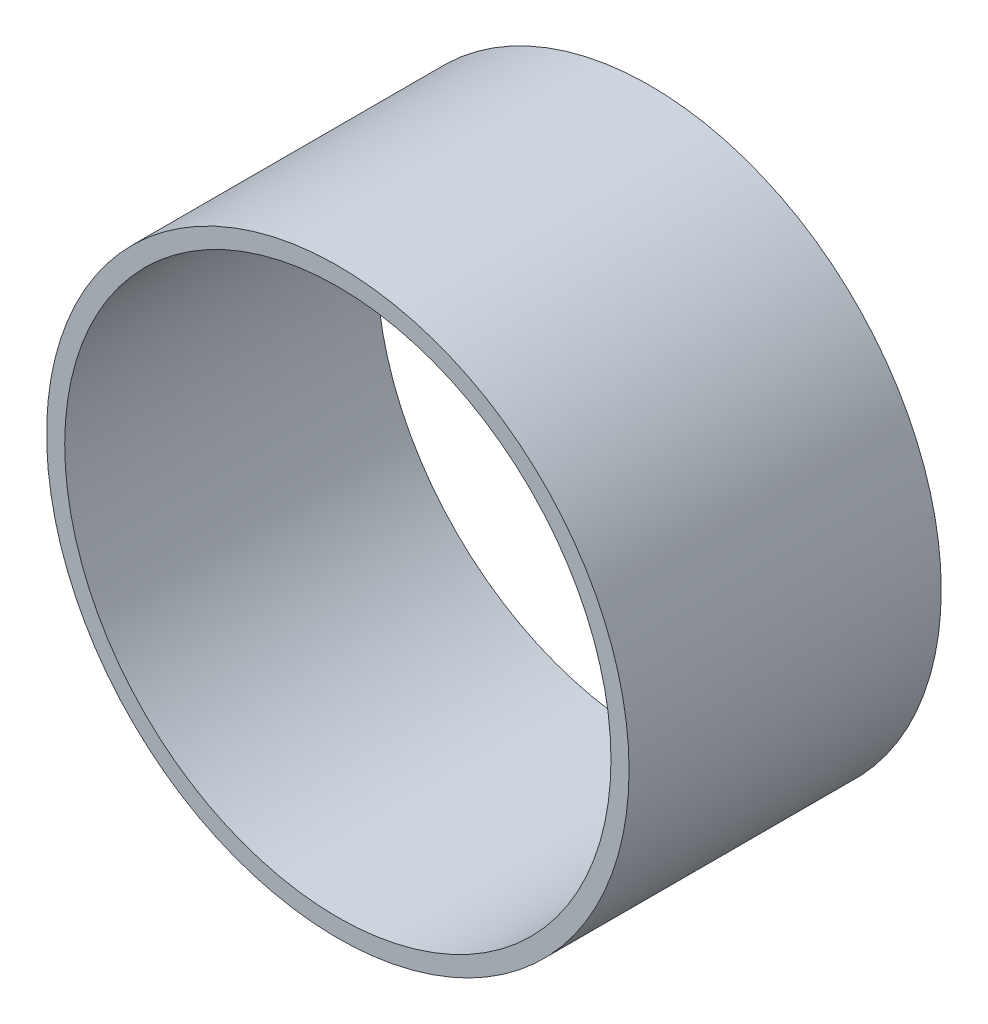
ISO-10303-21;
HEADER;
FILE_DESCRIPTION(('STEP AP214'),'2;1');
FILE_NAME('part.step','',(''),(''),'','','');
FILE_SCHEMA(('AUTOMOTIVE_DESIGN { 1 0 10303 214 1 1 1 1 }'));
ENDSEC;
DATA;
#1=APPLICATION_CONTEXT('core data for automotive mechanical design processes');
#2=APPLICATION_PROTOCOL_DEFINITION('international standard','automotive_design',2000,#1);
#3=PRODUCT_CONTEXT('',#1,'mechanical');
#4=PRODUCT('Part','Part','',(#3));
#5=PRODUCT_RELATED_PRODUCT_CATEGORY('part','',(#4));
#6=PRODUCT_DEFINITION_FORMATION('','',#4);
#7=PRODUCT_DEFINITION_CONTEXT('part definition',#1,'design');
#8=PRODUCT_DEFINITION('design','',#6,#7);
#9=PRODUCT_DEFINITION_SHAPE('','',#8);
#10=(LENGTH_UNIT() NAMED_UNIT(*) SI_UNIT(.MILLI.,.METRE.));
#11=(NAMED_UNIT(*) PLANE_ANGLE_UNIT() SI_UNIT($,.RADIAN.));
#12=(NAMED_UNIT(*) SI_UNIT($,.STERADIAN.) SOLID_ANGLE_UNIT());
#13=UNCERTAINTY_MEASURE_WITH_UNIT(LENGTH_MEASURE(1.E-05),#10,'distance_accuracy_value','');
#14=(GEOMETRIC_REPRESENTATION_CONTEXT(3) GLOBAL_UNCERTAINTY_ASSIGNED_CONTEXT((#13)) GLOBAL_UNIT_ASSIGNED_CONTEXT((#10,
#11,#12)) REPRESENTATION_CONTEXT('',''));
#15=CARTESIAN_POINT('',(0.,0.,0.));
#16=DIRECTION('',(0.,0.,1.));
#17=DIRECTION('',(1.,0.,0.));
#18=AXIS2_PLACEMENT_3D('',#15,#16,#17);
#19=CARTESIAN_POINT('',(0.,0.,25.4));
#20=DIRECTION('',(0.,0.,1.));
#21=DIRECTION('',(1.,0.,0.));
#22=AXIS2_PLACEMENT_3D('',#19,#20,#21);
#23=PLANE('',#22);
#24=CARTESIAN_POINT('',(0.,0.,25.4));
#25=DIRECTION('',(0.,0.,1.));
#26=DIRECTION('',(1.,0.,0.));
#27=AXIS2_PLACEMENT_3D('',#24,#25,#26);
#28=CIRCLE('',#27,23.6982);
#29=CARTESIAN_POINT('',(23.6982,0.,25.4));
#30=VERTEX_POINT('',#29);
#31=EDGE_CURVE('E10',#30,#30,#28,.T.);
#32=ORIENTED_EDGE('',*,*,#31,.T.);
#33=EDGE_LOOP('',(#32));
#34=FACE_BOUND('',#33,.T.);
#35=CARTESIAN_POINT('',(0.,0.,25.4));
#36=DIRECTION('',(0.,0.,1.));
#37=DIRECTION('',(1.,0.,0.));
#38=AXIS2_PLACEMENT_3D('',#35,#36,#37);
#39=CIRCLE('',#38,22.225);
#40=CARTESIAN_POINT('',(22.225,0.,25.4));
#41=VERTEX_POINT('',#40);
#42=EDGE_CURVE('E44',#41,#41,#39,.T.);
#43=ORIENTED_EDGE('',*,*,#42,.F.);
#44=EDGE_LOOP('',(#43));
#45=FACE_BOUND('',#44,.T.);
#46=ADVANCED_FACE('F33',(#34,#45),#23,.T.);
#47=CARTESIAN_POINT('',(0.,0.,0.));
#48=DIRECTION('',(0.,0.,1.));
#49=DIRECTION('',(1.,0.,0.));
#50=AXIS2_PLACEMENT_3D('',#47,#48,#49);
#51=PLANE('',#50);
#52=CARTESIAN_POINT('',(0.,0.,0.));
#53=DIRECTION('',(0.,0.,1.));
#54=DIRECTION('',(1.,0.,0.));
#55=AXIS2_PLACEMENT_3D('',#52,#53,#54);
#56=CIRCLE('',#55,23.6982);
#57=CARTESIAN_POINT('',(23.6982,0.,0.));
#58=VERTEX_POINT('',#57);
#59=EDGE_CURVE('E37',#58,#58,#56,.T.);
#60=ORIENTED_EDGE('',*,*,#59,.F.);
#61=EDGE_LOOP('',(#60));
#62=FACE_BOUND('',#61,.T.);
#63=CARTESIAN_POINT('',(0.,0.,0.));
#64=DIRECTION('',(0.,0.,1.));
#65=DIRECTION('',(1.,0.,0.));
#66=AXIS2_PLACEMENT_3D('',#63,#64,#65);
#67=CIRCLE('',#66,22.225);
#68=CARTESIAN_POINT('',(22.225,0.,0.));
#69=VERTEX_POINT('',#68);
#70=EDGE_CURVE('E46',#69,#69,#67,.T.);
#71=ORIENTED_EDGE('',*,*,#70,.T.);
#72=EDGE_LOOP('',(#71));
#73=FACE_BOUND('',#72,.T.);
#74=ADVANCED_FACE('F56',(#62,#73),#51,.F.);
#75=CARTESIAN_POINT('',(0.,0.,25.4));
#76=DIRECTION('',(0.,0.,-1.));
#77=DIRECTION('',(-1.,0.,0.));
#78=AXIS2_PLACEMENT_3D('',#75,#76,#77);
#79=CYLINDRICAL_SURFACE('',#78,23.6982);
#80=ORIENTED_EDGE('',*,*,#31,.F.);
#81=EDGE_LOOP('',(#80));
#82=FACE_BOUND('',#81,.T.);
#83=ORIENTED_EDGE('',*,*,#59,.T.);
#84=EDGE_LOOP('',(#83));
#85=FACE_BOUND('',#84,.T.);
#86=ADVANCED_FACE('F35',(#82,#85),#79,.T.);
#87=CARTESIAN_POINT('',(0.,0.,25.4));
#88=DIRECTION('',(0.,0.,-1.));
#89=DIRECTION('',(-1.,0.,0.));
#90=AXIS2_PLACEMENT_3D('',#87,#88,#89);
#91=CYLINDRICAL_SURFACE('',#90,22.225);
#92=ORIENTED_EDGE('',*,*,#42,.T.);
#93=EDGE_LOOP('',(#92));
#94=FACE_BOUND('',#93,.T.);
#95=ORIENTED_EDGE('',*,*,#70,.F.);
#96=EDGE_LOOP('',(#95));
#97=FACE_BOUND('',#96,.T.);
#98=ADVANCED_FACE('F52',(#94,#97),#91,.F.);
#99=CLOSED_SHELL('',(#46,#74,#86,#98));
#100=MANIFOLD_SOLID_BREP('B2',#99);
#101=ADVANCED_BREP_SHAPE_REPRESENTATION('',(#18,#100),#14);
#102=SHAPE_DEFINITION_REPRESENTATION(#9,#101);
ENDSEC;
END-ISO-10303-21;
